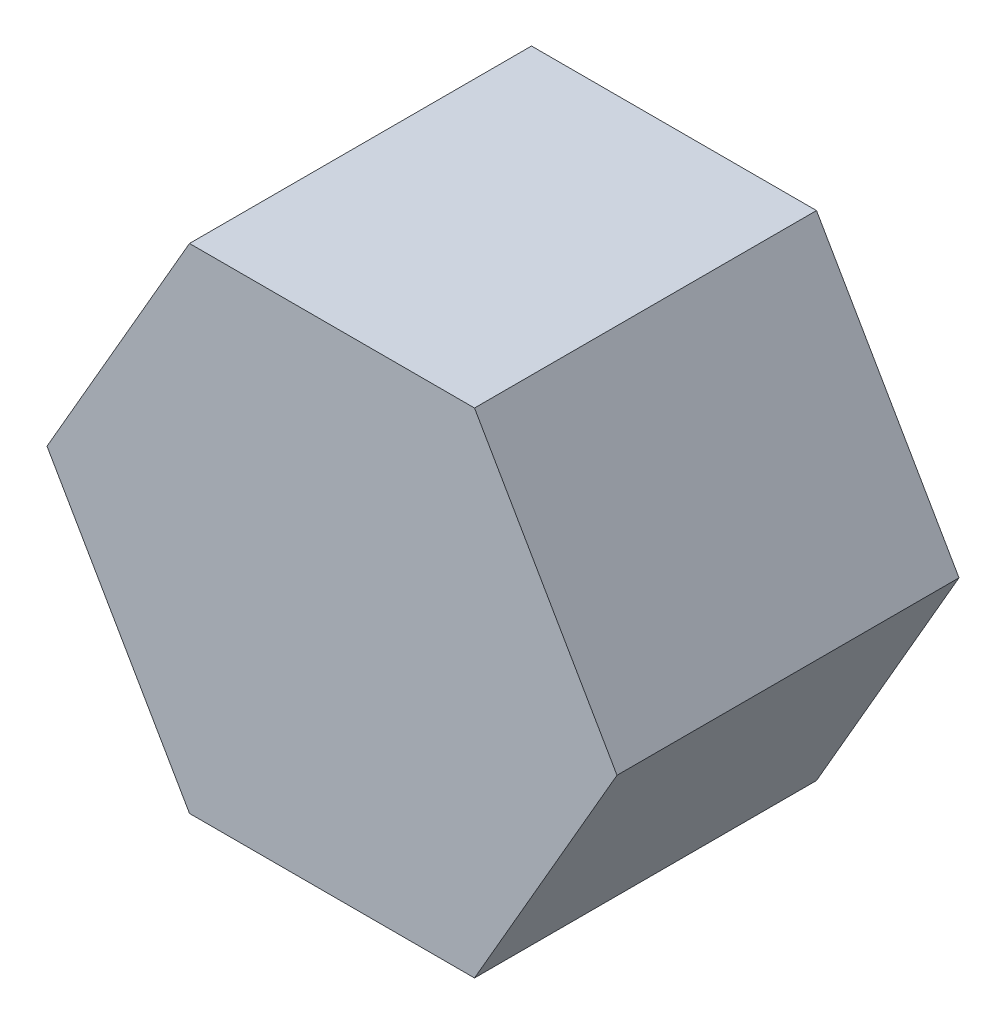
ISO-10303-21;
HEADER;
FILE_DESCRIPTION(('STEP AP214'),'2;1');
FILE_NAME('part.step','',(''),(''),'','','');
FILE_SCHEMA(('AUTOMOTIVE_DESIGN { 1 0 10303 214 1 1 1 1 }'));
ENDSEC;
DATA;
#1=APPLICATION_CONTEXT('core data for automotive mechanical design processes');
#2=APPLICATION_PROTOCOL_DEFINITION('international standard','automotive_design',2000,#1);
#3=PRODUCT_CONTEXT('',#1,'mechanical');
#4=PRODUCT('Part','Part','',(#3));
#5=PRODUCT_RELATED_PRODUCT_CATEGORY('part','',(#4));
#6=PRODUCT_DEFINITION_FORMATION('','',#4);
#7=PRODUCT_DEFINITION_CONTEXT('part definition',#1,'design');
#8=PRODUCT_DEFINITION('design','',#6,#7);
#9=PRODUCT_DEFINITION_SHAPE('','',#8);
#10=(LENGTH_UNIT() NAMED_UNIT(*) SI_UNIT(.MILLI.,.METRE.));
#11=(NAMED_UNIT(*) PLANE_ANGLE_UNIT() SI_UNIT($,.RADIAN.));
#12=(NAMED_UNIT(*) SI_UNIT($,.STERADIAN.) SOLID_ANGLE_UNIT());
#13=UNCERTAINTY_MEASURE_WITH_UNIT(LENGTH_MEASURE(1.E-05),#10,'distance_accuracy_value','');
#14=(GEOMETRIC_REPRESENTATION_CONTEXT(3) GLOBAL_UNCERTAINTY_ASSIGNED_CONTEXT((#13)) GLOBAL_UNIT_ASSIGNED_CONTEXT((#10,
#11,#12)) REPRESENTATION_CONTEXT('',''));
#15=CARTESIAN_POINT('',(0.,0.,0.));
#16=DIRECTION('',(0.,0.,1.));
#17=DIRECTION('',(1.,0.,0.));
#18=AXIS2_PLACEMENT_3D('',#15,#16,#17);
#19=CARTESIAN_POINT('',(-25.,0.,30.));
#20=DIRECTION('',(0.866025403784439,0.5,0.));
#21=DIRECTION('',(-0.5,0.866025403784439,0.));
#22=AXIS2_PLACEMENT_3D('',#19,#20,#21);
#23=PLANE('',#22);
#24=DIRECTION('',(0.5,-0.866025403784439,0.));
#25=VECTOR('',#24,1.);
#26=CARTESIAN_POINT('',(-25.,0.,0.));
#27=LINE('',#26,#25);
#28=CARTESIAN_POINT('',(-25.,0.,0.));
#29=VERTEX_POINT('',#28);
#30=CARTESIAN_POINT('',(-12.5,-21.650635094611,0.));
#31=VERTEX_POINT('',#30);
#32=EDGE_CURVE('E117',#29,#31,#27,.T.);
#33=ORIENTED_EDGE('',*,*,#32,.T.);
#34=DIRECTION('',(0.,0.,-1.));
#35=VECTOR('',#34,1.);
#36=CARTESIAN_POINT('',(-12.5,-21.650635094611,30.));
#37=LINE('',#36,#35);
#38=CARTESIAN_POINT('',(-12.5,-21.650635094611,30.));
#39=VERTEX_POINT('',#38);
#40=EDGE_CURVE('E11',#39,#31,#37,.T.);
#41=ORIENTED_EDGE('',*,*,#40,.F.);
#42=DIRECTION('',(0.5,-0.866025403784439,0.));
#43=VECTOR('',#42,1.);
#44=CARTESIAN_POINT('',(-25.,0.,30.));
#45=LINE('',#44,#43);
#46=CARTESIAN_POINT('',(-25.,0.,30.));
#47=VERTEX_POINT('',#46);
#48=EDGE_CURVE('E127',#47,#39,#45,.T.);
#49=ORIENTED_EDGE('',*,*,#48,.F.);
#50=DIRECTION('',(0.,0.,-1.));
#51=VECTOR('',#50,1.);
#52=CARTESIAN_POINT('',(-25.,0.,30.));
#53=LINE('',#52,#51);
#54=EDGE_CURVE('E113',#47,#29,#53,.T.);
#55=ORIENTED_EDGE('',*,*,#54,.T.);
#56=EDGE_LOOP('',(#33,#41,#49,#55));
#57=FACE_BOUND('',#56,.T.);
#58=ADVANCED_FACE('F33',(#57),#23,.F.);
#59=CARTESIAN_POINT('',(-12.5,-21.650635094611,30.));
#60=DIRECTION('',(0.,1.,0.));
#61=DIRECTION('',(-1.,0.,0.));
#62=AXIS2_PLACEMENT_3D('',#59,#60,#61);
#63=PLANE('',#62);
#64=DIRECTION('',(1.,0.,0.));
#65=VECTOR('',#64,1.);
#66=CARTESIAN_POINT('',(-12.5,-21.650635094611,0.));
#67=LINE('',#66,#65);
#68=CARTESIAN_POINT('',(12.5,-21.650635094611,0.));
#69=VERTEX_POINT('',#68);
#70=EDGE_CURVE('E120',#31,#69,#67,.T.);
#71=ORIENTED_EDGE('',*,*,#70,.T.);
#72=DIRECTION('',(0.,0.,-1.));
#73=VECTOR('',#72,1.);
#74=CARTESIAN_POINT('',(12.5,-21.650635094611,30.));
#75=LINE('',#74,#73);
#76=CARTESIAN_POINT('',(12.5,-21.650635094611,30.));
#77=VERTEX_POINT('',#76);
#78=EDGE_CURVE('E41',#77,#69,#75,.T.);
#79=ORIENTED_EDGE('',*,*,#78,.F.);
#80=DIRECTION('',(1.,0.,0.));
#81=VECTOR('',#80,1.);
#82=CARTESIAN_POINT('',(-12.5,-21.650635094611,30.));
#83=LINE('',#82,#81);
#84=EDGE_CURVE('E86',#39,#77,#83,.T.);
#85=ORIENTED_EDGE('',*,*,#84,.F.);
#86=ORIENTED_EDGE('',*,*,#40,.T.);
#87=EDGE_LOOP('',(#71,#79,#85,#86));
#88=FACE_BOUND('',#87,.T.);
#89=ADVANCED_FACE('F151',(#88),#63,.F.);
#90=CARTESIAN_POINT('',(12.5,-21.650635094611,30.));
#91=DIRECTION('',(-0.866025403784439,0.5,0.));
#92=DIRECTION('',(-0.5,-0.866025403784439,0.));
#93=AXIS2_PLACEMENT_3D('',#90,#91,#92);
#94=PLANE('',#93);
#95=DIRECTION('',(0.5,0.866025403784439,0.));
#96=VECTOR('',#95,1.);
#97=CARTESIAN_POINT('',(12.5,-21.650635094611,0.));
#98=LINE('',#97,#96);
#99=CARTESIAN_POINT('',(25.,0.,0.));
#100=VERTEX_POINT('',#99);
#101=EDGE_CURVE('E122',#69,#100,#98,.T.);
#102=ORIENTED_EDGE('',*,*,#101,.T.);
#103=DIRECTION('',(0.,0.,-1.));
#104=VECTOR('',#103,1.);
#105=CARTESIAN_POINT('',(25.,0.,30.));
#106=LINE('',#105,#104);
#107=CARTESIAN_POINT('',(25.,0.,30.));
#108=VERTEX_POINT('',#107);
#109=EDGE_CURVE('E108',#108,#100,#106,.T.);
#110=ORIENTED_EDGE('',*,*,#109,.F.);
#111=DIRECTION('',(0.5,0.866025403784439,0.));
#112=VECTOR('',#111,1.);
#113=CARTESIAN_POINT('',(12.5,-21.650635094611,30.));
#114=LINE('',#113,#112);
#115=EDGE_CURVE('E99',#77,#108,#114,.T.);
#116=ORIENTED_EDGE('',*,*,#115,.F.);
#117=ORIENTED_EDGE('',*,*,#78,.T.);
#118=EDGE_LOOP('',(#102,#110,#116,#117));
#119=FACE_BOUND('',#118,.T.);
#120=ADVANCED_FACE('F133',(#119),#94,.F.);
#121=CARTESIAN_POINT('',(25.,0.,30.));
#122=DIRECTION('',(-0.866025403784439,-0.5,0.));
#123=DIRECTION('',(0.5,-0.866025403784439,0.));
#124=AXIS2_PLACEMENT_3D('',#121,#122,#123);
#125=PLANE('',#124);
#126=DIRECTION('',(-0.5,0.866025403784439,0.));
#127=VECTOR('',#126,1.);
#128=CARTESIAN_POINT('',(25.,0.,0.));
#129=LINE('',#128,#127);
#130=CARTESIAN_POINT('',(12.5,21.650635094611,0.));
#131=VERTEX_POINT('',#130);
#132=EDGE_CURVE('E107',#100,#131,#129,.T.);
#133=ORIENTED_EDGE('',*,*,#132,.T.);
#134=DIRECTION('',(0.,0.,-1.));
#135=VECTOR('',#134,1.);
#136=CARTESIAN_POINT('',(12.5,21.650635094611,30.));
#137=LINE('',#136,#135);
#138=CARTESIAN_POINT('',(12.5,21.650635094611,30.));
#139=VERTEX_POINT('',#138);
#140=EDGE_CURVE('E104',#139,#131,#137,.T.);
#141=ORIENTED_EDGE('',*,*,#140,.F.);
#142=DIRECTION('',(-0.5,0.866025403784439,0.));
#143=VECTOR('',#142,1.);
#144=CARTESIAN_POINT('',(25.,0.,30.));
#145=LINE('',#144,#143);
#146=EDGE_CURVE('E93',#108,#139,#145,.T.);
#147=ORIENTED_EDGE('',*,*,#146,.F.);
#148=ORIENTED_EDGE('',*,*,#109,.T.);
#149=EDGE_LOOP('',(#133,#141,#147,#148));
#150=FACE_BOUND('',#149,.T.);
#151=ADVANCED_FACE('F105',(#150),#125,.F.);
#152=CARTESIAN_POINT('',(12.5,21.650635094611,30.));
#153=DIRECTION('',(0.,-1.,0.));
#154=DIRECTION('',(1.,0.,0.));
#155=AXIS2_PLACEMENT_3D('',#152,#153,#154);
#156=PLANE('',#155);
#157=DIRECTION('',(-1.,0.,0.));
#158=VECTOR('',#157,1.);
#159=CARTESIAN_POINT('',(12.5,21.650635094611,0.));
#160=LINE('',#159,#158);
#161=CARTESIAN_POINT('',(-12.5,21.650635094611,0.));
#162=VERTEX_POINT('',#161);
#163=EDGE_CURVE('E72',#131,#162,#160,.T.);
#164=ORIENTED_EDGE('',*,*,#163,.T.);
#165=DIRECTION('',(0.,0.,-1.));
#166=VECTOR('',#165,1.);
#167=CARTESIAN_POINT('',(-12.5,21.650635094611,30.));
#168=LINE('',#167,#166);
#169=CARTESIAN_POINT('',(-12.5,21.650635094611,30.));
#170=VERTEX_POINT('',#169);
#171=EDGE_CURVE('E109',#170,#162,#168,.T.);
#172=ORIENTED_EDGE('',*,*,#171,.F.);
#173=DIRECTION('',(-1.,0.,0.));
#174=VECTOR('',#173,1.);
#175=CARTESIAN_POINT('',(12.5,21.650635094611,30.));
#176=LINE('',#175,#174);
#177=EDGE_CURVE('E97',#139,#170,#176,.T.);
#178=ORIENTED_EDGE('',*,*,#177,.F.);
#179=ORIENTED_EDGE('',*,*,#140,.T.);
#180=EDGE_LOOP('',(#164,#172,#178,#179));
#181=FACE_BOUND('',#180,.T.);
#182=ADVANCED_FACE('F111',(#181),#156,.F.);
#183=CARTESIAN_POINT('',(-12.5,21.650635094611,30.));
#184=DIRECTION('',(0.866025403784438,-0.5,0.));
#185=DIRECTION('',(0.5,0.866025403784438,0.));
#186=AXIS2_PLACEMENT_3D('',#183,#184,#185);
#187=PLANE('',#186);
#188=DIRECTION('',(-0.5,-0.866025403784438,0.));
#189=VECTOR('',#188,1.);
#190=CARTESIAN_POINT('',(-12.5,21.650635094611,0.));
#191=LINE('',#190,#189);
#192=EDGE_CURVE('E78',#162,#29,#191,.T.);
#193=ORIENTED_EDGE('',*,*,#192,.T.);
#194=ORIENTED_EDGE('',*,*,#54,.F.);
#195=DIRECTION('',(-0.5,-0.866025403784438,0.));
#196=VECTOR('',#195,1.);
#197=CARTESIAN_POINT('',(-12.5,21.650635094611,30.));
#198=LINE('',#197,#196);
#199=EDGE_CURVE('E49',#170,#47,#198,.T.);
#200=ORIENTED_EDGE('',*,*,#199,.F.);
#201=ORIENTED_EDGE('',*,*,#171,.T.);
#202=EDGE_LOOP('',(#193,#194,#200,#201));
#203=FACE_BOUND('',#202,.T.);
#204=ADVANCED_FACE('F140',(#203),#187,.F.);
#205=CARTESIAN_POINT('',(0.,0.,30.));
#206=DIRECTION('',(0.,0.,1.));
#207=DIRECTION('',(1.,0.,0.));
#208=AXIS2_PLACEMENT_3D('',#205,#206,#207);
#209=PLANE('',#208);
#210=ORIENTED_EDGE('',*,*,#48,.T.);
#211=ORIENTED_EDGE('',*,*,#84,.T.);
#212=ORIENTED_EDGE('',*,*,#115,.T.);
#213=ORIENTED_EDGE('',*,*,#146,.T.);
#214=ORIENTED_EDGE('',*,*,#177,.T.);
#215=ORIENTED_EDGE('',*,*,#199,.T.);
#216=EDGE_LOOP('',(#210,#211,#212,#213,#214,#215));
#217=FACE_BOUND('',#216,.T.);
#218=ADVANCED_FACE('F95',(#217),#209,.T.);
#219=CARTESIAN_POINT('',(0.,0.,0.));
#220=DIRECTION('',(0.,0.,1.));
#221=DIRECTION('',(1.,0.,0.));
#222=AXIS2_PLACEMENT_3D('',#219,#220,#221);
#223=PLANE('',#222);
#224=ORIENTED_EDGE('',*,*,#32,.F.);
#225=ORIENTED_EDGE('',*,*,#192,.F.);
#226=ORIENTED_EDGE('',*,*,#163,.F.);
#227=ORIENTED_EDGE('',*,*,#132,.F.);
#228=ORIENTED_EDGE('',*,*,#101,.F.);
#229=ORIENTED_EDGE('',*,*,#70,.F.);
#230=EDGE_LOOP('',(#224,#225,#226,#227,#228,#229));
#231=FACE_BOUND('',#230,.T.);
#232=ADVANCED_FACE('F136',(#231),#223,.F.);
#233=CLOSED_SHELL('',(#58,#89,#120,#151,#182,#204,#218,#232));
#234=MANIFOLD_SOLID_BREP('B2',#233);
#235=ADVANCED_BREP_SHAPE_REPRESENTATION('',(#18,#234),#14);
#236=SHAPE_DEFINITION_REPRESENTATION(#9,#235);
ENDSEC;
END-ISO-10303-21;
